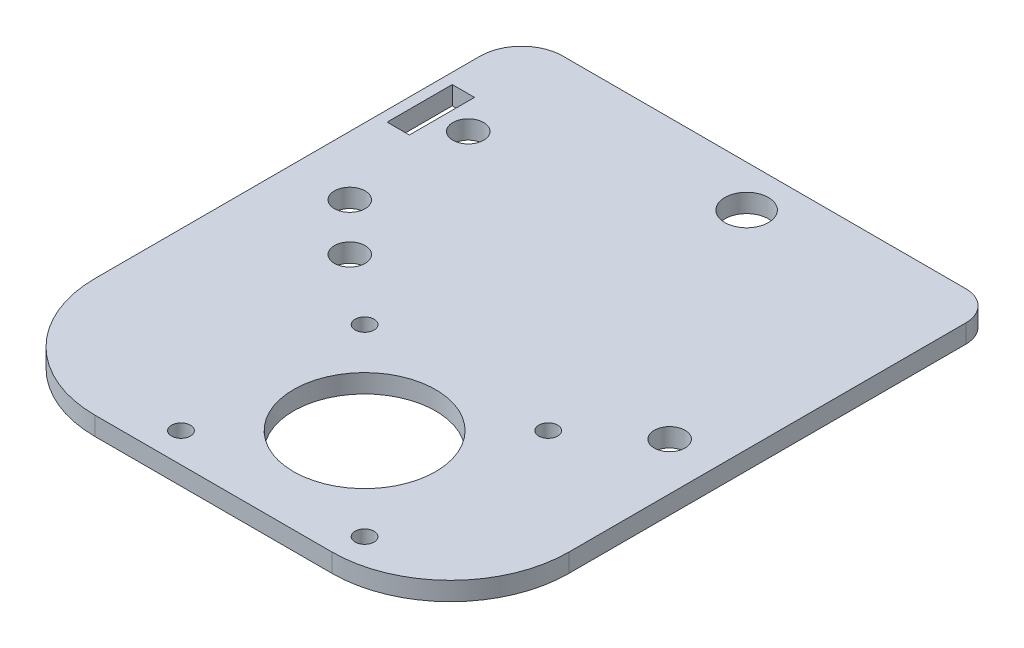
ISO-10303-21;
HEADER;
FILE_DESCRIPTION(('STEP AP214'),'2;1');
FILE_NAME('part.step','',(''),(''),'','','');
FILE_SCHEMA(('AUTOMOTIVE_DESIGN { 1 0 10303 214 1 1 1 1 }'));
ENDSEC;
DATA;
#1=APPLICATION_CONTEXT('core data for automotive mechanical design processes');
#2=APPLICATION_PROTOCOL_DEFINITION('international standard','automotive_design',2000,#1);
#3=PRODUCT_CONTEXT('',#1,'mechanical');
#4=PRODUCT('Part','Part','',(#3));
#5=PRODUCT_RELATED_PRODUCT_CATEGORY('part','',(#4));
#6=PRODUCT_DEFINITION_FORMATION('','',#4);
#7=PRODUCT_DEFINITION_CONTEXT('part definition',#1,'design');
#8=PRODUCT_DEFINITION('design','',#6,#7);
#9=PRODUCT_DEFINITION_SHAPE('','',#8);
#10=(LENGTH_UNIT() NAMED_UNIT(*) SI_UNIT(.MILLI.,.METRE.));
#11=(NAMED_UNIT(*) PLANE_ANGLE_UNIT() SI_UNIT($,.RADIAN.));
#12=(NAMED_UNIT(*) SI_UNIT($,.STERADIAN.) SOLID_ANGLE_UNIT());
#13=UNCERTAINTY_MEASURE_WITH_UNIT(LENGTH_MEASURE(1.E-05),#10,'distance_accuracy_value','');
#14=(GEOMETRIC_REPRESENTATION_CONTEXT(3) GLOBAL_UNCERTAINTY_ASSIGNED_CONTEXT((#13)) GLOBAL_UNIT_ASSIGNED_CONTEXT((#10,
#11,#12)) REPRESENTATION_CONTEXT('',''));
#15=CARTESIAN_POINT('',(0.,0.,0.));
#16=DIRECTION('',(0.,0.,1.));
#17=DIRECTION('',(1.,0.,0.));
#18=AXIS2_PLACEMENT_3D('',#15,#16,#17);
#19=CARTESIAN_POINT('',(0.,3.125,0.));
#20=DIRECTION('',(0.,-1.,0.));
#21=DIRECTION('',(0.,0.,-1.));
#22=AXIS2_PLACEMENT_3D('',#19,#20,#21);
#23=PLANE('',#22);
#24=DIRECTION('',(-1.,0.,0.));
#25=VECTOR('',#24,1.);
#26=CARTESIAN_POINT('',(5.56066017175302,3.125,-78.5));
#27=LINE('',#26,#25);
#28=CARTESIAN_POINT('',(5.56066017175302,3.125,-78.5));
#29=VERTEX_POINT('',#28);
#30=CARTESIAN_POINT('',(1.79999999997318,3.125,-78.5));
#31=VERTEX_POINT('',#30);
#32=EDGE_CURVE('E123',#29,#31,#27,.T.);
#33=ORIENTED_EDGE('',*,*,#32,.F.);
#34=DIRECTION('',(0.,0.,-1.));
#35=VECTOR('',#34,1.);
#36=CARTESIAN_POINT('',(5.56066017175302,3.125,-67.5));
#37=LINE('',#36,#35);
#38=CARTESIAN_POINT('',(5.56066017175302,3.125,-67.5));
#39=VERTEX_POINT('',#38);
#40=EDGE_CURVE('E149',#39,#29,#37,.T.);
#41=ORIENTED_EDGE('',*,*,#40,.F.);
#42=DIRECTION('',(1.,0.,0.));
#43=VECTOR('',#42,1.);
#44=CARTESIAN_POINT('',(1.79999999997322,3.125,-67.5));
#45=LINE('',#44,#43);
#46=CARTESIAN_POINT('',(1.79999999997322,3.125,-67.5));
#47=VERTEX_POINT('',#46);
#48=EDGE_CURVE('E147',#47,#39,#45,.T.);
#49=ORIENTED_EDGE('',*,*,#48,.F.);
#50=DIRECTION('',(0.,0.,1.));
#51=VECTOR('',#50,1.);
#52=CARTESIAN_POINT('',(1.79999999997318,3.125,-78.5));
#53=LINE('',#52,#51);
#54=EDGE_CURVE('E133',#31,#47,#53,.T.);
#55=ORIENTED_EDGE('',*,*,#54,.F.);
#56=EDGE_LOOP('',(#33,#41,#49,#55));
#57=FACE_BOUND('',#56,.T.);
#58=CARTESIAN_POINT('',(72.,3.125,-45.));
#59=DIRECTION('',(0.,1.,0.));
#60=DIRECTION('',(0.,0.,1.));
#61=AXIS2_PLACEMENT_3D('',#58,#59,#60);
#62=CIRCLE('',#61,2.59999999999997);
#63=CARTESIAN_POINT('',(72.,3.125,-42.4));
#64=VERTEX_POINT('',#63);
#65=EDGE_CURVE('E173',#64,#64,#62,.T.);
#66=ORIENTED_EDGE('',*,*,#65,.F.);
#67=EDGE_LOOP('',(#66));
#68=FACE_BOUND('',#67,.T.);
#69=CARTESIAN_POINT('',(60.5,3.125,-5.));
#70=DIRECTION('',(0.,1.,0.));
#71=DIRECTION('',(0.,0.,1.));
#72=AXIS2_PLACEMENT_3D('',#69,#70,#71);
#73=CIRCLE('',#72,1.6);
#74=CARTESIAN_POINT('',(60.5,3.125,-3.4));
#75=VERTEX_POINT('',#74);
#76=EDGE_CURVE('E185',#75,#75,#73,.T.);
#77=ORIENTED_EDGE('',*,*,#76,.F.);
#78=EDGE_LOOP('',(#77));
#79=FACE_BOUND('',#78,.T.);
#80=CARTESIAN_POINT('',(29.5,3.125,-36.));
#81=DIRECTION('',(0.,1.,0.));
#82=DIRECTION('',(0.,0.,1.));
#83=AXIS2_PLACEMENT_3D('',#80,#81,#82);
#84=CIRCLE('',#83,1.6);
#85=CARTESIAN_POINT('',(29.5,3.125,-34.4));
#86=VERTEX_POINT('',#85);
#87=EDGE_CURVE('E197',#86,#86,#84,.T.);
#88=ORIENTED_EDGE('',*,*,#87,.F.);
#89=EDGE_LOOP('',(#88));
#90=FACE_BOUND('',#89,.T.);
#91=CARTESIAN_POINT('',(10.,3.125,-53.));
#92=DIRECTION('',(0.,1.,0.));
#93=DIRECTION('',(0.,0.,1.));
#94=AXIS2_PLACEMENT_3D('',#91,#92,#93);
#95=CIRCLE('',#94,2.6);
#96=CARTESIAN_POINT('',(10.,3.125,-50.4));
#97=VERTEX_POINT('',#96);
#98=EDGE_CURVE('E209',#97,#97,#95,.T.);
#99=ORIENTED_EDGE('',*,*,#98,.F.);
#100=EDGE_LOOP('',(#99));
#101=FACE_BOUND('',#100,.T.);
#102=DIRECTION('',(-1.,0.,0.));
#103=VECTOR('',#102,1.);
#104=CARTESIAN_POINT('',(0.,3.125,-92.));
#105=LINE('',#104,#103);
#106=CARTESIAN_POINT('',(75.,3.125,-92.));
#107=VERTEX_POINT('',#106);
#108=CARTESIAN_POINT('',(7.,3.125,-92.));
#109=VERTEX_POINT('',#108);
#110=EDGE_CURVE('E227',#107,#109,#105,.T.);
#111=ORIENTED_EDGE('',*,*,#110,.T.);
#112=CARTESIAN_POINT('',(7.,3.125,-85.));
#113=DIRECTION('',(0.,-1.,0.));
#114=DIRECTION('',(0.,0.,-1.));
#115=AXIS2_PLACEMENT_3D('',#112,#113,#114);
#116=CIRCLE('',#115,7.);
#117=CARTESIAN_POINT('',(0.,3.125,-85.));
#118=VERTEX_POINT('',#117);
#119=EDGE_CURVE('E11',#109,#118,#116,.F.);
#120=ORIENTED_EDGE('',*,*,#119,.T.);
#121=DIRECTION('',(0.,0.,1.));
#122=VECTOR('',#121,1.);
#123=CARTESIAN_POINT('',(0.,3.125,0.));
#124=LINE('',#123,#122);
#125=CARTESIAN_POINT('',(0.,3.125,-20.));
#126=VERTEX_POINT('',#125);
#127=EDGE_CURVE('E229',#118,#126,#124,.T.);
#128=ORIENTED_EDGE('',*,*,#127,.T.);
#129=CARTESIAN_POINT('',(20.,3.125,-20.));
#130=DIRECTION('',(0.,-1.,0.));
#131=DIRECTION('',(0.,0.,-1.));
#132=AXIS2_PLACEMENT_3D('',#129,#130,#131);
#133=CIRCLE('',#132,20.);
#134=CARTESIAN_POINT('',(20.,3.125,0.));
#135=VERTEX_POINT('',#134);
#136=EDGE_CURVE('E258',#126,#135,#133,.F.);
#137=ORIENTED_EDGE('',*,*,#136,.T.);
#138=DIRECTION('',(1.,0.,0.));
#139=VECTOR('',#138,1.);
#140=CARTESIAN_POINT('',(80.,3.125,0.));
#141=LINE('',#140,#139);
#142=CARTESIAN_POINT('',(60.,3.125,0.));
#143=VERTEX_POINT('',#142);
#144=EDGE_CURVE('E221',#135,#143,#141,.T.);
#145=ORIENTED_EDGE('',*,*,#144,.T.);
#146=CARTESIAN_POINT('',(60.,3.125,-20.));
#147=DIRECTION('',(0.,-1.,0.));
#148=DIRECTION('',(0.,0.,-1.));
#149=AXIS2_PLACEMENT_3D('',#146,#147,#148);
#150=CIRCLE('',#149,20.);
#151=CARTESIAN_POINT('',(80.,3.125,-20.));
#152=VERTEX_POINT('',#151);
#153=EDGE_CURVE('E247',#143,#152,#150,.F.);
#154=ORIENTED_EDGE('',*,*,#153,.T.);
#155=DIRECTION('',(0.,0.,-1.));
#156=VECTOR('',#155,1.);
#157=CARTESIAN_POINT('',(80.,3.125,-92.));
#158=LINE('',#157,#156);
#159=CARTESIAN_POINT('',(80.,3.125,-87.));
#160=VERTEX_POINT('',#159);
#161=EDGE_CURVE('E223',#152,#160,#158,.T.);
#162=ORIENTED_EDGE('',*,*,#161,.T.);
#163=CARTESIAN_POINT('',(75.,3.125,-87.));
#164=DIRECTION('',(0.,-1.,0.));
#165=DIRECTION('',(0.,0.,-1.));
#166=AXIS2_PLACEMENT_3D('',#163,#164,#165);
#167=CIRCLE('',#166,5.);
#168=EDGE_CURVE('E267',#160,#107,#167,.F.);
#169=ORIENTED_EDGE('',*,*,#168,.T.);
#170=EDGE_LOOP('',(#111,#120,#128,#137,#145,#154,#162,#169));
#171=FACE_BOUND('',#170,.T.);
#172=CARTESIAN_POINT('',(45.,3.125,-85.));
#173=DIRECTION('',(0.,1.,0.));
#174=DIRECTION('',(0.,0.,1.));
#175=AXIS2_PLACEMENT_3D('',#172,#173,#174);
#176=CIRCLE('',#175,3.675);
#177=CARTESIAN_POINT('',(45.,3.125,-81.325));
#178=VERTEX_POINT('',#177);
#179=EDGE_CURVE('E215',#178,#178,#176,.T.);
#180=ORIENTED_EDGE('',*,*,#179,.F.);
#181=EDGE_LOOP('',(#180));
#182=FACE_BOUND('',#181,.T.);
#183=CARTESIAN_POINT('',(29.5,3.125,-4.99999999999999));
#184=DIRECTION('',(0.,1.,0.));
#185=DIRECTION('',(0.,0.,1.));
#186=AXIS2_PLACEMENT_3D('',#183,#184,#185);
#187=CIRCLE('',#186,1.6);
#188=CARTESIAN_POINT('',(29.5,3.125,-3.39999999999999));
#189=VERTEX_POINT('',#188);
#190=EDGE_CURVE('E203',#189,#189,#187,.T.);
#191=ORIENTED_EDGE('',*,*,#190,.F.);
#192=EDGE_LOOP('',(#191));
#193=FACE_BOUND('',#192,.T.);
#194=CARTESIAN_POINT('',(60.5,3.125,-36.));
#195=DIRECTION('',(0.,1.,0.));
#196=DIRECTION('',(0.,0.,1.));
#197=AXIS2_PLACEMENT_3D('',#194,#195,#196);
#198=CIRCLE('',#197,1.6);
#199=CARTESIAN_POINT('',(60.5,3.125,-34.4));
#200=VERTEX_POINT('',#199);
#201=EDGE_CURVE('E191',#200,#200,#198,.T.);
#202=ORIENTED_EDGE('',*,*,#201,.F.);
#203=EDGE_LOOP('',(#202));
#204=FACE_BOUND('',#203,.T.);
#205=CARTESIAN_POINT('',(18.,3.125,-45.));
#206=DIRECTION('',(0.,1.,0.));
#207=DIRECTION('',(0.,0.,1.));
#208=AXIS2_PLACEMENT_3D('',#205,#206,#207);
#209=CIRCLE('',#208,2.6);
#210=CARTESIAN_POINT('',(18.,3.125,-42.4));
#211=VERTEX_POINT('',#210);
#212=EDGE_CURVE('E179',#211,#211,#209,.T.);
#213=ORIENTED_EDGE('',*,*,#212,.F.);
#214=EDGE_LOOP('',(#213));
#215=FACE_BOUND('',#214,.T.);
#216=CARTESIAN_POINT('',(45.,3.125,-20.5));
#217=DIRECTION('',(0.,1.,0.));
#218=DIRECTION('',(0.,0.,1.));
#219=AXIS2_PLACEMENT_3D('',#216,#217,#218);
#220=CIRCLE('',#219,12.);
#221=CARTESIAN_POINT('',(45.,3.125,-8.49999999999998));
#222=VERTEX_POINT('',#221);
#223=EDGE_CURVE('E167',#222,#222,#220,.T.);
#224=ORIENTED_EDGE('',*,*,#223,.F.);
#225=EDGE_LOOP('',(#224));
#226=FACE_BOUND('',#225,.T.);
#227=CARTESIAN_POINT('',(9.99999999997318,3.125,-73.));
#228=DIRECTION('',(0.,1.,0.));
#229=DIRECTION('',(0.,0.,1.));
#230=AXIS2_PLACEMENT_3D('',#227,#228,#229);
#231=CIRCLE('',#230,2.60000000000001);
#232=CARTESIAN_POINT('',(9.99999999997318,3.125,-70.4));
#233=VERTEX_POINT('',#232);
#234=EDGE_CURVE('E156',#233,#233,#231,.T.);
#235=ORIENTED_EDGE('',*,*,#234,.F.);
#236=EDGE_LOOP('',(#235));
#237=FACE_BOUND('',#236,.T.);
#238=ADVANCED_FACE('F33',(#57,#68,#79,#90,#101,#171,#182,#193,#204,#215,#226,#237),#23,.F.);
#239=CARTESIAN_POINT('',(0.,0.,0.));
#240=DIRECTION('',(0.,-1.,0.));
#241=DIRECTION('',(0.,0.,-1.));
#242=AXIS2_PLACEMENT_3D('',#239,#240,#241);
#243=PLANE('',#242);
#244=DIRECTION('',(0.,0.,-1.));
#245=VECTOR('',#244,1.);
#246=CARTESIAN_POINT('',(5.56066017175302,0.,-67.5));
#247=LINE('',#246,#245);
#248=CARTESIAN_POINT('',(5.56066017175302,0.,-67.5));
#249=VERTEX_POINT('',#248);
#250=CARTESIAN_POINT('',(5.56066017175302,0.,-78.5));
#251=VERTEX_POINT('',#250);
#252=EDGE_CURVE('E134',#249,#251,#247,.T.);
#253=ORIENTED_EDGE('',*,*,#252,.T.);
#254=DIRECTION('',(-1.,0.,0.));
#255=VECTOR('',#254,1.);
#256=CARTESIAN_POINT('',(5.56066017175302,0.,-78.5));
#257=LINE('',#256,#255);
#258=CARTESIAN_POINT('',(1.79999999997318,0.,-78.5));
#259=VERTEX_POINT('',#258);
#260=EDGE_CURVE('E154',#251,#259,#257,.T.);
#261=ORIENTED_EDGE('',*,*,#260,.T.);
#262=DIRECTION('',(0.,0.,1.));
#263=VECTOR('',#262,1.);
#264=CARTESIAN_POINT('',(1.79999999997318,0.,-78.5));
#265=LINE('',#264,#263);
#266=CARTESIAN_POINT('',(1.79999999997322,0.,-67.5));
#267=VERTEX_POINT('',#266);
#268=EDGE_CURVE('E140',#259,#267,#265,.T.);
#269=ORIENTED_EDGE('',*,*,#268,.T.);
#270=DIRECTION('',(1.,0.,0.));
#271=VECTOR('',#270,1.);
#272=CARTESIAN_POINT('',(1.79999999997322,0.,-67.5));
#273=LINE('',#272,#271);
#274=EDGE_CURVE('E158',#267,#249,#273,.T.);
#275=ORIENTED_EDGE('',*,*,#274,.T.);
#276=EDGE_LOOP('',(#253,#261,#269,#275));
#277=FACE_BOUND('',#276,.T.);
#278=CARTESIAN_POINT('',(72.,0.,-45.));
#279=DIRECTION('',(0.,1.,0.));
#280=DIRECTION('',(0.,0.,1.));
#281=AXIS2_PLACEMENT_3D('',#278,#279,#280);
#282=CIRCLE('',#281,2.59999999999997);
#283=CARTESIAN_POINT('',(72.,0.,-42.4));
#284=VERTEX_POINT('',#283);
#285=EDGE_CURVE('E170',#284,#284,#282,.T.);
#286=ORIENTED_EDGE('',*,*,#285,.T.);
#287=EDGE_LOOP('',(#286));
#288=FACE_BOUND('',#287,.T.);
#289=CARTESIAN_POINT('',(60.5,0.,-5.));
#290=DIRECTION('',(0.,1.,0.));
#291=DIRECTION('',(0.,0.,1.));
#292=AXIS2_PLACEMENT_3D('',#289,#290,#291);
#293=CIRCLE('',#292,1.6);
#294=CARTESIAN_POINT('',(60.5,0.,-3.4));
#295=VERTEX_POINT('',#294);
#296=EDGE_CURVE('E182',#295,#295,#293,.T.);
#297=ORIENTED_EDGE('',*,*,#296,.T.);
#298=EDGE_LOOP('',(#297));
#299=FACE_BOUND('',#298,.T.);
#300=CARTESIAN_POINT('',(29.5,0.,-36.));
#301=DIRECTION('',(0.,1.,0.));
#302=DIRECTION('',(0.,0.,1.));
#303=AXIS2_PLACEMENT_3D('',#300,#301,#302);
#304=CIRCLE('',#303,1.6);
#305=CARTESIAN_POINT('',(29.5,0.,-34.4));
#306=VERTEX_POINT('',#305);
#307=EDGE_CURVE('E194',#306,#306,#304,.T.);
#308=ORIENTED_EDGE('',*,*,#307,.T.);
#309=EDGE_LOOP('',(#308));
#310=FACE_BOUND('',#309,.T.);
#311=CARTESIAN_POINT('',(10.,0.,-53.));
#312=DIRECTION('',(0.,1.,0.));
#313=DIRECTION('',(0.,0.,1.));
#314=AXIS2_PLACEMENT_3D('',#311,#312,#313);
#315=CIRCLE('',#314,2.6);
#316=CARTESIAN_POINT('',(10.,0.,-50.4));
#317=VERTEX_POINT('',#316);
#318=EDGE_CURVE('E206',#317,#317,#315,.T.);
#319=ORIENTED_EDGE('',*,*,#318,.T.);
#320=EDGE_LOOP('',(#319));
#321=FACE_BOUND('',#320,.T.);
#322=DIRECTION('',(0.,0.,1.));
#323=VECTOR('',#322,1.);
#324=CARTESIAN_POINT('',(0.,0.,0.));
#325=LINE('',#324,#323);
#326=CARTESIAN_POINT('',(0.,0.,-85.));
#327=VERTEX_POINT('',#326);
#328=CARTESIAN_POINT('',(0.,0.,-20.));
#329=VERTEX_POINT('',#328);
#330=EDGE_CURVE('E224',#327,#329,#325,.T.);
#331=ORIENTED_EDGE('',*,*,#330,.F.);
#332=CARTESIAN_POINT('',(7.,0.,-85.));
#333=DIRECTION('',(0.,-1.,0.));
#334=DIRECTION('',(0.,0.,-1.));
#335=AXIS2_PLACEMENT_3D('',#332,#333,#334);
#336=CIRCLE('',#335,7.);
#337=CARTESIAN_POINT('',(7.,0.,-92.));
#338=VERTEX_POINT('',#337);
#339=EDGE_CURVE('E55',#327,#338,#336,.T.);
#340=ORIENTED_EDGE('',*,*,#339,.T.);
#341=DIRECTION('',(-1.,0.,0.));
#342=VECTOR('',#341,1.);
#343=CARTESIAN_POINT('',(0.,0.,-92.));
#344=LINE('',#343,#342);
#345=CARTESIAN_POINT('',(75.,0.,-92.));
#346=VERTEX_POINT('',#345);
#347=EDGE_CURVE('E236',#346,#338,#344,.T.);
#348=ORIENTED_EDGE('',*,*,#347,.F.);
#349=CARTESIAN_POINT('',(75.,0.,-87.));
#350=DIRECTION('',(0.,-1.,0.));
#351=DIRECTION('',(0.,0.,-1.));
#352=AXIS2_PLACEMENT_3D('',#349,#350,#351);
#353=CIRCLE('',#352,5.);
#354=CARTESIAN_POINT('',(80.,0.,-87.));
#355=VERTEX_POINT('',#354);
#356=EDGE_CURVE('E263',#346,#355,#353,.T.);
#357=ORIENTED_EDGE('',*,*,#356,.T.);
#358=DIRECTION('',(0.,0.,-1.));
#359=VECTOR('',#358,1.);
#360=CARTESIAN_POINT('',(80.,0.,-92.));
#361=LINE('',#360,#359);
#362=CARTESIAN_POINT('',(80.,0.,-20.));
#363=VERTEX_POINT('',#362);
#364=EDGE_CURVE('E233',#363,#355,#361,.T.);
#365=ORIENTED_EDGE('',*,*,#364,.F.);
#366=CARTESIAN_POINT('',(60.,0.,-20.));
#367=DIRECTION('',(0.,-1.,0.));
#368=DIRECTION('',(0.,0.,-1.));
#369=AXIS2_PLACEMENT_3D('',#366,#367,#368);
#370=CIRCLE('',#369,20.);
#371=CARTESIAN_POINT('',(60.,0.,0.));
#372=VERTEX_POINT('',#371);
#373=EDGE_CURVE('E241',#363,#372,#370,.T.);
#374=ORIENTED_EDGE('',*,*,#373,.T.);
#375=DIRECTION('',(1.,0.,0.));
#376=VECTOR('',#375,1.);
#377=CARTESIAN_POINT('',(80.,0.,0.));
#378=LINE('',#377,#376);
#379=CARTESIAN_POINT('',(20.,0.,0.));
#380=VERTEX_POINT('',#379);
#381=EDGE_CURVE('E218',#380,#372,#378,.T.);
#382=ORIENTED_EDGE('',*,*,#381,.F.);
#383=CARTESIAN_POINT('',(20.,0.,-20.));
#384=DIRECTION('',(0.,-1.,0.));
#385=DIRECTION('',(0.,0.,-1.));
#386=AXIS2_PLACEMENT_3D('',#383,#384,#385);
#387=CIRCLE('',#386,20.);
#388=EDGE_CURVE('E252',#380,#329,#387,.T.);
#389=ORIENTED_EDGE('',*,*,#388,.T.);
#390=EDGE_LOOP('',(#331,#340,#348,#357,#365,#374,#382,#389));
#391=FACE_BOUND('',#390,.T.);
#392=CARTESIAN_POINT('',(45.,0.,-85.));
#393=DIRECTION('',(0.,1.,0.));
#394=DIRECTION('',(0.,0.,1.));
#395=AXIS2_PLACEMENT_3D('',#392,#393,#394);
#396=CIRCLE('',#395,3.675);
#397=CARTESIAN_POINT('',(45.,0.,-81.325));
#398=VERTEX_POINT('',#397);
#399=EDGE_CURVE('E212',#398,#398,#396,.T.);
#400=ORIENTED_EDGE('',*,*,#399,.T.);
#401=EDGE_LOOP('',(#400));
#402=FACE_BOUND('',#401,.T.);
#403=CARTESIAN_POINT('',(29.5,0.,-4.99999999999999));
#404=DIRECTION('',(0.,1.,0.));
#405=DIRECTION('',(0.,0.,1.));
#406=AXIS2_PLACEMENT_3D('',#403,#404,#405);
#407=CIRCLE('',#406,1.6);
#408=CARTESIAN_POINT('',(29.5,0.,-3.39999999999999));
#409=VERTEX_POINT('',#408);
#410=EDGE_CURVE('E200',#409,#409,#407,.T.);
#411=ORIENTED_EDGE('',*,*,#410,.T.);
#412=EDGE_LOOP('',(#411));
#413=FACE_BOUND('',#412,.T.);
#414=CARTESIAN_POINT('',(60.5,0.,-36.));
#415=DIRECTION('',(0.,1.,0.));
#416=DIRECTION('',(0.,0.,1.));
#417=AXIS2_PLACEMENT_3D('',#414,#415,#416);
#418=CIRCLE('',#417,1.6);
#419=CARTESIAN_POINT('',(60.5,0.,-34.4));
#420=VERTEX_POINT('',#419);
#421=EDGE_CURVE('E188',#420,#420,#418,.T.);
#422=ORIENTED_EDGE('',*,*,#421,.T.);
#423=EDGE_LOOP('',(#422));
#424=FACE_BOUND('',#423,.T.);
#425=CARTESIAN_POINT('',(18.,0.,-45.));
#426=DIRECTION('',(0.,1.,0.));
#427=DIRECTION('',(0.,0.,1.));
#428=AXIS2_PLACEMENT_3D('',#425,#426,#427);
#429=CIRCLE('',#428,2.6);
#430=CARTESIAN_POINT('',(18.,0.,-42.4));
#431=VERTEX_POINT('',#430);
#432=EDGE_CURVE('E176',#431,#431,#429,.T.);
#433=ORIENTED_EDGE('',*,*,#432,.T.);
#434=EDGE_LOOP('',(#433));
#435=FACE_BOUND('',#434,.T.);
#436=CARTESIAN_POINT('',(45.,0.,-20.5));
#437=DIRECTION('',(0.,1.,0.));
#438=DIRECTION('',(0.,0.,1.));
#439=AXIS2_PLACEMENT_3D('',#436,#437,#438);
#440=CIRCLE('',#439,12.);
#441=CARTESIAN_POINT('',(45.,0.,-8.49999999999998));
#442=VERTEX_POINT('',#441);
#443=EDGE_CURVE('E141',#442,#442,#440,.T.);
#444=ORIENTED_EDGE('',*,*,#443,.T.);
#445=EDGE_LOOP('',(#444));
#446=FACE_BOUND('',#445,.T.);
#447=CARTESIAN_POINT('',(9.99999999997318,0.,-73.));
#448=DIRECTION('',(0.,1.,0.));
#449=DIRECTION('',(0.,0.,1.));
#450=AXIS2_PLACEMENT_3D('',#447,#448,#449);
#451=CIRCLE('',#450,2.60000000000001);
#452=CARTESIAN_POINT('',(9.99999999997318,0.,-70.4));
#453=VERTEX_POINT('',#452);
#454=EDGE_CURVE('E526',#453,#453,#451,.T.);
#455=ORIENTED_EDGE('',*,*,#454,.T.);
#456=EDGE_LOOP('',(#455));
#457=FACE_BOUND('',#456,.T.);
#458=ADVANCED_FACE('F278',(#277,#288,#299,#310,#321,#391,#402,#413,#424,#435,#446,#457),#243,.T.);
#459=CARTESIAN_POINT('',(80.,3.125,0.));
#460=DIRECTION('',(0.,0.,-1.));
#461=DIRECTION('',(-1.,0.,0.));
#462=AXIS2_PLACEMENT_3D('',#459,#460,#461);
#463=PLANE('',#462);
#464=ORIENTED_EDGE('',*,*,#144,.F.);
#465=DIRECTION('',(0.,-1.,0.));
#466=VECTOR('',#465,1.);
#467=CARTESIAN_POINT('',(20.,3.125,0.));
#468=LINE('',#467,#466);
#469=EDGE_CURVE('E249',#135,#380,#468,.T.);
#470=ORIENTED_EDGE('',*,*,#469,.T.);
#471=ORIENTED_EDGE('',*,*,#381,.T.);
#472=DIRECTION('',(0.,-1.,0.));
#473=VECTOR('',#472,1.);
#474=CARTESIAN_POINT('',(60.,3.125,0.));
#475=LINE('',#474,#473);
#476=EDGE_CURVE('E244',#372,#143,#475,.F.);
#477=ORIENTED_EDGE('',*,*,#476,.T.);
#478=EDGE_LOOP('',(#464,#470,#471,#477));
#479=FACE_BOUND('',#478,.T.);
#480=ADVANCED_FACE('F290',(#479),#463,.F.);
#481=CARTESIAN_POINT('',(80.,3.125,-92.));
#482=DIRECTION('',(-1.,0.,0.));
#483=DIRECTION('',(0.,0.,1.));
#484=AXIS2_PLACEMENT_3D('',#481,#482,#483);
#485=PLANE('',#484);
#486=ORIENTED_EDGE('',*,*,#364,.T.);
#487=DIRECTION('',(0.,-1.,0.));
#488=VECTOR('',#487,1.);
#489=CARTESIAN_POINT('',(80.,3.125,-87.));
#490=LINE('',#489,#488);
#491=EDGE_CURVE('E265',#355,#160,#490,.F.);
#492=ORIENTED_EDGE('',*,*,#491,.T.);
#493=ORIENTED_EDGE('',*,*,#161,.F.);
#494=DIRECTION('',(0.,-1.,0.));
#495=VECTOR('',#494,1.);
#496=CARTESIAN_POINT('',(80.,3.125,-20.));
#497=LINE('',#496,#495);
#498=EDGE_CURVE('E231',#152,#363,#497,.T.);
#499=ORIENTED_EDGE('',*,*,#498,.T.);
#500=EDGE_LOOP('',(#486,#492,#493,#499));
#501=FACE_BOUND('',#500,.T.);
#502=ADVANCED_FACE('F299',(#501),#485,.F.);
#503=CARTESIAN_POINT('',(0.,3.125,-92.));
#504=DIRECTION('',(0.,0.,1.));
#505=DIRECTION('',(1.,0.,0.));
#506=AXIS2_PLACEMENT_3D('',#503,#504,#505);
#507=PLANE('',#506);
#508=ORIENTED_EDGE('',*,*,#347,.T.);
#509=DIRECTION('',(0.,-1.,0.));
#510=VECTOR('',#509,1.);
#511=CARTESIAN_POINT('',(7.,3.125,-92.));
#512=LINE('',#511,#510);
#513=EDGE_CURVE('E41',#338,#109,#512,.F.);
#514=ORIENTED_EDGE('',*,*,#513,.T.);
#515=ORIENTED_EDGE('',*,*,#110,.F.);
#516=DIRECTION('',(0.,-1.,0.));
#517=VECTOR('',#516,1.);
#518=CARTESIAN_POINT('',(75.,3.125,-92.));
#519=LINE('',#518,#517);
#520=EDGE_CURVE('E260',#107,#346,#519,.T.);
#521=ORIENTED_EDGE('',*,*,#520,.T.);
#522=EDGE_LOOP('',(#508,#514,#515,#521));
#523=FACE_BOUND('',#522,.T.);
#524=ADVANCED_FACE('F305',(#523),#507,.F.);
#525=CARTESIAN_POINT('',(0.,3.125,0.));
#526=DIRECTION('',(1.,0.,0.));
#527=DIRECTION('',(0.,0.,-1.));
#528=AXIS2_PLACEMENT_3D('',#525,#526,#527);
#529=PLANE('',#528);
#530=ORIENTED_EDGE('',*,*,#127,.F.);
#531=DIRECTION('',(0.,-1.,0.));
#532=VECTOR('',#531,1.);
#533=CARTESIAN_POINT('',(0.,3.125,-85.));
#534=LINE('',#533,#532);
#535=EDGE_CURVE('E269',#118,#327,#534,.T.);
#536=ORIENTED_EDGE('',*,*,#535,.T.);
#537=ORIENTED_EDGE('',*,*,#330,.T.);
#538=DIRECTION('',(0.,-1.,0.));
#539=VECTOR('',#538,1.);
#540=CARTESIAN_POINT('',(0.,3.125,-20.));
#541=LINE('',#540,#539);
#542=EDGE_CURVE('E255',#329,#126,#541,.F.);
#543=ORIENTED_EDGE('',*,*,#542,.T.);
#544=EDGE_LOOP('',(#530,#536,#537,#543));
#545=FACE_BOUND('',#544,.T.);
#546=ADVANCED_FACE('F275',(#545),#529,.F.);
#547=CARTESIAN_POINT('',(45.,3.125,-85.));
#548=DIRECTION('',(0.,-1.,0.));
#549=DIRECTION('',(0.,0.,-1.));
#550=AXIS2_PLACEMENT_3D('',#547,#548,#549);
#551=CYLINDRICAL_SURFACE('',#550,3.675);
#552=ORIENTED_EDGE('',*,*,#179,.T.);
#553=EDGE_LOOP('',(#552));
#554=FACE_BOUND('',#553,.T.);
#555=ORIENTED_EDGE('',*,*,#399,.F.);
#556=EDGE_LOOP('',(#555));
#557=FACE_BOUND('',#556,.T.);
#558=ADVANCED_FACE('F318',(#554,#557),#551,.F.);
#559=CARTESIAN_POINT('',(10.,3.125,-53.));
#560=DIRECTION('',(0.,-1.,0.));
#561=DIRECTION('',(0.,0.,-1.));
#562=AXIS2_PLACEMENT_3D('',#559,#560,#561);
#563=CYLINDRICAL_SURFACE('',#562,2.6);
#564=ORIENTED_EDGE('',*,*,#98,.T.);
#565=EDGE_LOOP('',(#564));
#566=FACE_BOUND('',#565,.T.);
#567=ORIENTED_EDGE('',*,*,#318,.F.);
#568=EDGE_LOOP('',(#567));
#569=FACE_BOUND('',#568,.T.);
#570=ADVANCED_FACE('F382',(#566,#569),#563,.F.);
#571=CARTESIAN_POINT('',(29.5,3.125,-4.99999999999999));
#572=DIRECTION('',(0.,-1.,0.));
#573=DIRECTION('',(0.,0.,-1.));
#574=AXIS2_PLACEMENT_3D('',#571,#572,#573);
#575=CYLINDRICAL_SURFACE('',#574,1.6);
#576=ORIENTED_EDGE('',*,*,#190,.T.);
#577=EDGE_LOOP('',(#576));
#578=FACE_BOUND('',#577,.T.);
#579=ORIENTED_EDGE('',*,*,#410,.F.);
#580=EDGE_LOOP('',(#579));
#581=FACE_BOUND('',#580,.T.);
#582=ADVANCED_FACE('F388',(#578,#581),#575,.F.);
#583=CARTESIAN_POINT('',(29.5,3.125,-36.));
#584=DIRECTION('',(0.,-1.,0.));
#585=DIRECTION('',(0.,0.,-1.));
#586=AXIS2_PLACEMENT_3D('',#583,#584,#585);
#587=CYLINDRICAL_SURFACE('',#586,1.6);
#588=ORIENTED_EDGE('',*,*,#87,.T.);
#589=EDGE_LOOP('',(#588));
#590=FACE_BOUND('',#589,.T.);
#591=ORIENTED_EDGE('',*,*,#307,.F.);
#592=EDGE_LOOP('',(#591));
#593=FACE_BOUND('',#592,.T.);
#594=ADVANCED_FACE('F395',(#590,#593),#587,.F.);
#595=CARTESIAN_POINT('',(60.5,3.125,-36.));
#596=DIRECTION('',(0.,-1.,0.));
#597=DIRECTION('',(0.,0.,-1.));
#598=AXIS2_PLACEMENT_3D('',#595,#596,#597);
#599=CYLINDRICAL_SURFACE('',#598,1.6);
#600=ORIENTED_EDGE('',*,*,#201,.T.);
#601=EDGE_LOOP('',(#600));
#602=FACE_BOUND('',#601,.T.);
#603=ORIENTED_EDGE('',*,*,#421,.F.);
#604=EDGE_LOOP('',(#603));
#605=FACE_BOUND('',#604,.T.);
#606=ADVANCED_FACE('F403',(#602,#605),#599,.F.);
#607=CARTESIAN_POINT('',(60.5,3.125,-5.));
#608=DIRECTION('',(0.,-1.,0.));
#609=DIRECTION('',(0.,0.,-1.));
#610=AXIS2_PLACEMENT_3D('',#607,#608,#609);
#611=CYLINDRICAL_SURFACE('',#610,1.6);
#612=ORIENTED_EDGE('',*,*,#76,.T.);
#613=EDGE_LOOP('',(#612));
#614=FACE_BOUND('',#613,.T.);
#615=ORIENTED_EDGE('',*,*,#296,.F.);
#616=EDGE_LOOP('',(#615));
#617=FACE_BOUND('',#616,.T.);
#618=ADVANCED_FACE('F411',(#614,#617),#611,.F.);
#619=CARTESIAN_POINT('',(18.,3.125,-45.));
#620=DIRECTION('',(0.,-1.,0.));
#621=DIRECTION('',(0.,0.,-1.));
#622=AXIS2_PLACEMENT_3D('',#619,#620,#621);
#623=CYLINDRICAL_SURFACE('',#622,2.6);
#624=ORIENTED_EDGE('',*,*,#212,.T.);
#625=EDGE_LOOP('',(#624));
#626=FACE_BOUND('',#625,.T.);
#627=ORIENTED_EDGE('',*,*,#432,.F.);
#628=EDGE_LOOP('',(#627));
#629=FACE_BOUND('',#628,.T.);
#630=ADVANCED_FACE('F419',(#626,#629),#623,.F.);
#631=CARTESIAN_POINT('',(72.,3.125,-45.));
#632=DIRECTION('',(0.,-1.,0.));
#633=DIRECTION('',(0.,0.,-1.));
#634=AXIS2_PLACEMENT_3D('',#631,#632,#633);
#635=CYLINDRICAL_SURFACE('',#634,2.59999999999997);
#636=ORIENTED_EDGE('',*,*,#65,.T.);
#637=EDGE_LOOP('',(#636));
#638=FACE_BOUND('',#637,.T.);
#639=ORIENTED_EDGE('',*,*,#285,.F.);
#640=EDGE_LOOP('',(#639));
#641=FACE_BOUND('',#640,.T.);
#642=ADVANCED_FACE('F427',(#638,#641),#635,.F.);
#643=CARTESIAN_POINT('',(45.,3.125,-20.5));
#644=DIRECTION('',(0.,-1.,0.));
#645=DIRECTION('',(0.,0.,-1.));
#646=AXIS2_PLACEMENT_3D('',#643,#644,#645);
#647=CYLINDRICAL_SURFACE('',#646,12.);
#648=ORIENTED_EDGE('',*,*,#223,.T.);
#649=EDGE_LOOP('',(#648));
#650=FACE_BOUND('',#649,.T.);
#651=ORIENTED_EDGE('',*,*,#443,.F.);
#652=EDGE_LOOP('',(#651));
#653=FACE_BOUND('',#652,.T.);
#654=ADVANCED_FACE('F435',(#650,#653),#647,.F.);
#655=CARTESIAN_POINT('',(5.56066017175302,3.125,-78.5));
#656=DIRECTION('',(0.,0.,1.));
#657=DIRECTION('',(1.,0.,0.));
#658=AXIS2_PLACEMENT_3D('',#655,#656,#657);
#659=PLANE('',#658);
#660=ORIENTED_EDGE('',*,*,#260,.F.);
#661=DIRECTION('',(0.,-1.,0.));
#662=VECTOR('',#661,1.);
#663=CARTESIAN_POINT('',(5.56066017175302,3.125,-78.5));
#664=LINE('',#663,#662);
#665=EDGE_CURVE('E129',#29,#251,#664,.T.);
#666=ORIENTED_EDGE('',*,*,#665,.F.);
#667=ORIENTED_EDGE('',*,*,#32,.T.);
#668=DIRECTION('',(0.,-1.,0.));
#669=VECTOR('',#668,1.);
#670=CARTESIAN_POINT('',(1.79999999997318,3.125,-78.5));
#671=LINE('',#670,#669);
#672=EDGE_CURVE('E126',#31,#259,#671,.T.);
#673=ORIENTED_EDGE('',*,*,#672,.T.);
#674=EDGE_LOOP('',(#660,#666,#667,#673));
#675=FACE_BOUND('',#674,.T.);
#676=ADVANCED_FACE('F125',(#675),#659,.T.);
#677=CARTESIAN_POINT('',(1.79999999997318,3.125,-78.5));
#678=DIRECTION('',(1.,0.,0.));
#679=DIRECTION('',(0.,0.,-1.));
#680=AXIS2_PLACEMENT_3D('',#677,#678,#679);
#681=PLANE('',#680);
#682=ORIENTED_EDGE('',*,*,#268,.F.);
#683=ORIENTED_EDGE('',*,*,#672,.F.);
#684=ORIENTED_EDGE('',*,*,#54,.T.);
#685=DIRECTION('',(0.,-1.,0.));
#686=VECTOR('',#685,1.);
#687=CARTESIAN_POINT('',(1.79999999997322,3.125,-67.5));
#688=LINE('',#687,#686);
#689=EDGE_CURVE('E142',#47,#267,#688,.T.);
#690=ORIENTED_EDGE('',*,*,#689,.T.);
#691=EDGE_LOOP('',(#682,#683,#684,#690));
#692=FACE_BOUND('',#691,.T.);
#693=ADVANCED_FACE('F137',(#692),#681,.T.);
#694=CARTESIAN_POINT('',(1.79999999997322,3.125,-67.5));
#695=DIRECTION('',(0.,0.,-1.));
#696=DIRECTION('',(-1.,0.,0.));
#697=AXIS2_PLACEMENT_3D('',#694,#695,#696);
#698=PLANE('',#697);
#699=ORIENTED_EDGE('',*,*,#274,.F.);
#700=ORIENTED_EDGE('',*,*,#689,.F.);
#701=ORIENTED_EDGE('',*,*,#48,.T.);
#702=DIRECTION('',(0.,-1.,0.));
#703=VECTOR('',#702,1.);
#704=CARTESIAN_POINT('',(5.56066017175302,3.125,-67.5));
#705=LINE('',#704,#703);
#706=EDGE_CURVE('E164',#39,#249,#705,.T.);
#707=ORIENTED_EDGE('',*,*,#706,.T.);
#708=EDGE_LOOP('',(#699,#700,#701,#707));
#709=FACE_BOUND('',#708,.T.);
#710=ADVANCED_FACE('F456',(#709),#698,.T.);
#711=CARTESIAN_POINT('',(5.56066017175302,3.125,-67.5));
#712=DIRECTION('',(-1.,0.,0.));
#713=DIRECTION('',(0.,0.,1.));
#714=AXIS2_PLACEMENT_3D('',#711,#712,#713);
#715=PLANE('',#714);
#716=ORIENTED_EDGE('',*,*,#252,.F.);
#717=ORIENTED_EDGE('',*,*,#706,.F.);
#718=ORIENTED_EDGE('',*,*,#40,.T.);
#719=ORIENTED_EDGE('',*,*,#665,.T.);
#720=EDGE_LOOP('',(#716,#717,#718,#719));
#721=FACE_BOUND('',#720,.T.);
#722=ADVANCED_FACE('F463',(#721),#715,.T.);
#723=CARTESIAN_POINT('',(9.99999999997318,3.125,-73.));
#724=DIRECTION('',(0.,-1.,0.));
#725=DIRECTION('',(0.,0.,-1.));
#726=AXIS2_PLACEMENT_3D('',#723,#724,#725);
#727=CYLINDRICAL_SURFACE('',#726,2.60000000000001);
#728=ORIENTED_EDGE('',*,*,#234,.T.);
#729=EDGE_LOOP('',(#728));
#730=FACE_BOUND('',#729,.T.);
#731=ORIENTED_EDGE('',*,*,#454,.F.);
#732=EDGE_LOOP('',(#731));
#733=FACE_BOUND('',#732,.T.);
#734=ADVANCED_FACE('F331',(#730,#733),#727,.F.);
#735=CARTESIAN_POINT('',(60.,3.125,-20.));
#736=DIRECTION('',(0.,-1.,0.));
#737=DIRECTION('',(0.,0.,-1.));
#738=AXIS2_PLACEMENT_3D('',#735,#736,#737);
#739=CYLINDRICAL_SURFACE('',#738,20.);
#740=ORIENTED_EDGE('',*,*,#153,.F.);
#741=ORIENTED_EDGE('',*,*,#476,.F.);
#742=ORIENTED_EDGE('',*,*,#373,.F.);
#743=ORIENTED_EDGE('',*,*,#498,.F.);
#744=EDGE_LOOP('',(#740,#741,#742,#743));
#745=FACE_BOUND('',#744,.T.);
#746=ADVANCED_FACE('F295',(#745),#739,.T.);
#747=CARTESIAN_POINT('',(20.,3.125,-20.));
#748=DIRECTION('',(0.,-1.,0.));
#749=DIRECTION('',(0.,0.,-1.));
#750=AXIS2_PLACEMENT_3D('',#747,#748,#749);
#751=CYLINDRICAL_SURFACE('',#750,20.);
#752=ORIENTED_EDGE('',*,*,#136,.F.);
#753=ORIENTED_EDGE('',*,*,#542,.F.);
#754=ORIENTED_EDGE('',*,*,#388,.F.);
#755=ORIENTED_EDGE('',*,*,#469,.F.);
#756=EDGE_LOOP('',(#752,#753,#754,#755));
#757=FACE_BOUND('',#756,.T.);
#758=ADVANCED_FACE('F285',(#757),#751,.T.);
#759=CARTESIAN_POINT('',(75.,3.125,-87.));
#760=DIRECTION('',(0.,-1.,0.));
#761=DIRECTION('',(0.,0.,-1.));
#762=AXIS2_PLACEMENT_3D('',#759,#760,#761);
#763=CYLINDRICAL_SURFACE('',#762,5.);
#764=ORIENTED_EDGE('',*,*,#168,.F.);
#765=ORIENTED_EDGE('',*,*,#491,.F.);
#766=ORIENTED_EDGE('',*,*,#356,.F.);
#767=ORIENTED_EDGE('',*,*,#520,.F.);
#768=EDGE_LOOP('',(#764,#765,#766,#767));
#769=FACE_BOUND('',#768,.T.);
#770=ADVANCED_FACE('F303',(#769),#763,.T.);
#771=CARTESIAN_POINT('',(7.,3.125,-85.));
#772=DIRECTION('',(0.,-1.,0.));
#773=DIRECTION('',(0.,0.,-1.));
#774=AXIS2_PLACEMENT_3D('',#771,#772,#773);
#775=CYLINDRICAL_SURFACE('',#774,7.);
#776=ORIENTED_EDGE('',*,*,#119,.F.);
#777=ORIENTED_EDGE('',*,*,#513,.F.);
#778=ORIENTED_EDGE('',*,*,#339,.F.);
#779=ORIENTED_EDGE('',*,*,#535,.F.);
#780=EDGE_LOOP('',(#776,#777,#778,#779));
#781=FACE_BOUND('',#780,.T.);
#782=ADVANCED_FACE('F35',(#781),#775,.T.);
#783=CLOSED_SHELL('',(#238,#458,#480,#502,#524,#546,#558,#570,#582,#594,#606,#618,#630,#642,
#654,#676,#693,#710,#722,#734,#746,#758,#770,#782));
#784=MANIFOLD_SOLID_BREP('B2',#783);
#785=ADVANCED_BREP_SHAPE_REPRESENTATION('',(#18,#784),#14);
#786=SHAPE_DEFINITION_REPRESENTATION(#9,#785);
ENDSEC;
END-ISO-10303-21;
